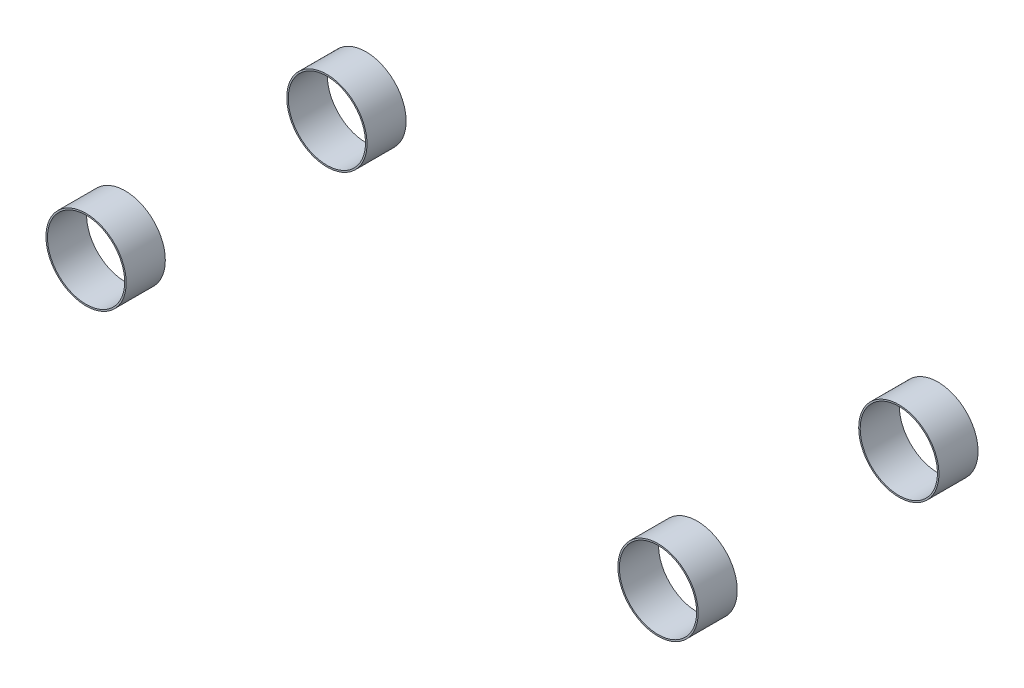
ISO-10303-21;
HEADER;
FILE_DESCRIPTION(('STEP AP214'),'2;1');
FILE_NAME('part.step','',(''),(''),'','','');
FILE_SCHEMA(('AUTOMOTIVE_DESIGN { 1 0 10303 214 1 1 1 1 }'));
ENDSEC;
DATA;
#1=APPLICATION_CONTEXT('core data for automotive mechanical design processes');
#2=APPLICATION_PROTOCOL_DEFINITION('international standard','automotive_design',2000,#1);
#3=PRODUCT_CONTEXT('',#1,'mechanical');
#4=PRODUCT('Part','Part','',(#3));
#5=PRODUCT_RELATED_PRODUCT_CATEGORY('part','',(#4));
#6=PRODUCT_DEFINITION_FORMATION('','',#4);
#7=PRODUCT_DEFINITION_CONTEXT('part definition',#1,'design');
#8=PRODUCT_DEFINITION('design','',#6,#7);
#9=PRODUCT_DEFINITION_SHAPE('','',#8);
#10=(LENGTH_UNIT() NAMED_UNIT(*) SI_UNIT(.MILLI.,.METRE.));
#11=(NAMED_UNIT(*) PLANE_ANGLE_UNIT() SI_UNIT($,.RADIAN.));
#12=(NAMED_UNIT(*) SI_UNIT($,.STERADIAN.) SOLID_ANGLE_UNIT());
#13=UNCERTAINTY_MEASURE_WITH_UNIT(LENGTH_MEASURE(1.E-05),#10,'distance_accuracy_value','');
#14=(GEOMETRIC_REPRESENTATION_CONTEXT(3) GLOBAL_UNCERTAINTY_ASSIGNED_CONTEXT((#13)) GLOBAL_UNIT_ASSIGNED_CONTEXT((#10,
#11,#12)) REPRESENTATION_CONTEXT('',''));
#15=CARTESIAN_POINT('',(0.,0.,0.));
#16=DIRECTION('',(0.,0.,1.));
#17=DIRECTION('',(1.,0.,0.));
#18=AXIS2_PLACEMENT_3D('',#15,#16,#17);
#19=CARTESIAN_POINT('',(-1425.00000000001,0.,-697.49999999999));
#20=DIRECTION('',(0.,0.,-1.));
#21=DIRECTION('',(-1.,0.,0.));
#22=AXIS2_PLACEMENT_3D('',#19,#20,#21);
#23=PLANE('',#22);
#24=CARTESIAN_POINT('',(-1425.00000000001,0.,-697.49999999999));
#25=DIRECTION('',(0.,0.,-1.));
#26=DIRECTION('',(-1.,0.,0.));
#27=AXIS2_PLACEMENT_3D('',#24,#25,#26);
#28=CIRCLE('',#27,200.);
#29=CARTESIAN_POINT('',(-1625.00000000001,0.,-697.499999999989));
#30=VERTEX_POINT('',#29);
#31=EDGE_CURVE('E11',#30,#30,#28,.T.);
#32=ORIENTED_EDGE('',*,*,#31,.T.);
#33=EDGE_LOOP('',(#32));
#34=FACE_BOUND('',#33,.T.);
#35=CARTESIAN_POINT('',(-1425.00000000001,0.,-697.49999999999));
#36=DIRECTION('',(0.,0.,-1.));
#37=DIRECTION('',(-1.,0.,0.));
#38=AXIS2_PLACEMENT_3D('',#35,#36,#37);
#39=CIRCLE('',#38,192.5);
#40=CARTESIAN_POINT('',(-1617.50000000001,0.,-697.499999999989));
#41=VERTEX_POINT('',#40);
#42=EDGE_CURVE('E55',#41,#41,#39,.T.);
#43=ORIENTED_EDGE('',*,*,#42,.F.);
#44=EDGE_LOOP('',(#43));
#45=FACE_BOUND('',#44,.T.);
#46=ADVANCED_FACE('F44',(#34,#45),#23,.T.);
#47=CARTESIAN_POINT('',(-1425.00000000001,0.,-502.49999999999));
#48=DIRECTION('',(0.,0.,-1.));
#49=DIRECTION('',(-1.,0.,0.));
#50=AXIS2_PLACEMENT_3D('',#47,#48,#49);
#51=PLANE('',#50);
#52=CARTESIAN_POINT('',(-1425.00000000001,0.,-502.49999999999));
#53=DIRECTION('',(0.,0.,-1.));
#54=DIRECTION('',(-1.,0.,0.));
#55=AXIS2_PLACEMENT_3D('',#52,#53,#54);
#56=CIRCLE('',#55,200.);
#57=CARTESIAN_POINT('',(-1625.00000000001,0.,-502.499999999989));
#58=VERTEX_POINT('',#57);
#59=EDGE_CURVE('E48',#58,#58,#56,.T.);
#60=ORIENTED_EDGE('',*,*,#59,.F.);
#61=EDGE_LOOP('',(#60));
#62=FACE_BOUND('',#61,.T.);
#63=CARTESIAN_POINT('',(-1425.00000000001,0.,-502.49999999999));
#64=DIRECTION('',(0.,0.,-1.));
#65=DIRECTION('',(-1.,0.,0.));
#66=AXIS2_PLACEMENT_3D('',#63,#64,#65);
#67=CIRCLE('',#66,192.5);
#68=CARTESIAN_POINT('',(-1617.50000000001,0.,-502.499999999989));
#69=VERTEX_POINT('',#68);
#70=EDGE_CURVE('E57',#69,#69,#67,.T.);
#71=ORIENTED_EDGE('',*,*,#70,.T.);
#72=EDGE_LOOP('',(#71));
#73=FACE_BOUND('',#72,.T.);
#74=ADVANCED_FACE('F67',(#62,#73),#51,.F.);
#75=CARTESIAN_POINT('',(-1425.00000000001,0.,-697.49999999999));
#76=DIRECTION('',(0.,0.,1.));
#77=DIRECTION('',(1.,0.,0.));
#78=AXIS2_PLACEMENT_3D('',#75,#76,#77);
#79=CYLINDRICAL_SURFACE('',#78,200.);
#80=ORIENTED_EDGE('',*,*,#31,.F.);
#81=EDGE_LOOP('',(#80));
#82=FACE_BOUND('',#81,.T.);
#83=ORIENTED_EDGE('',*,*,#59,.T.);
#84=EDGE_LOOP('',(#83));
#85=FACE_BOUND('',#84,.T.);
#86=ADVANCED_FACE('F46',(#82,#85),#79,.T.);
#87=CARTESIAN_POINT('',(-1425.00000000001,0.,-697.49999999999));
#88=DIRECTION('',(0.,0.,1.));
#89=DIRECTION('',(1.,0.,0.));
#90=AXIS2_PLACEMENT_3D('',#87,#88,#89);
#91=CYLINDRICAL_SURFACE('',#90,192.5);
#92=ORIENTED_EDGE('',*,*,#42,.T.);
#93=EDGE_LOOP('',(#92));
#94=FACE_BOUND('',#93,.T.);
#95=ORIENTED_EDGE('',*,*,#70,.F.);
#96=EDGE_LOOP('',(#95));
#97=FACE_BOUND('',#96,.T.);
#98=ADVANCED_FACE('F63',(#94,#97),#91,.F.);
#99=CLOSED_SHELL('',(#46,#74,#86,#98));
#100=MANIFOLD_SOLID_BREP('B2',#99);
#101=CARTESIAN_POINT('',(1424.99999999999,0.,-697.50000000001));
#102=DIRECTION('',(0.,0.,-1.));
#103=DIRECTION('',(-1.,0.,0.));
#104=AXIS2_PLACEMENT_3D('',#101,#102,#103);
#105=PLANE('',#104);
#106=CARTESIAN_POINT('',(1424.99999999999,0.,-697.50000000001));
#107=DIRECTION('',(0.,0.,-1.));
#108=DIRECTION('',(-1.,0.,0.));
#109=AXIS2_PLACEMENT_3D('',#106,#107,#108);
#110=CIRCLE('',#109,200.);
#111=CARTESIAN_POINT('',(1224.99999999999,0.,-697.500000000009));
#112=VERTEX_POINT('',#111);
#113=EDGE_CURVE('E43',#112,#112,#110,.T.);
#114=ORIENTED_EDGE('',*,*,#113,.T.);
#115=EDGE_LOOP('',(#114));
#116=FACE_BOUND('',#115,.T.);
#117=CARTESIAN_POINT('',(1424.99999999999,0.,-697.50000000001));
#118=DIRECTION('',(0.,0.,-1.));
#119=DIRECTION('',(-1.,0.,0.));
#120=AXIS2_PLACEMENT_3D('',#117,#118,#119);
#121=CIRCLE('',#120,192.5);
#122=CARTESIAN_POINT('',(1232.49999999999,0.,-697.500000000009));
#123=VERTEX_POINT('',#122);
#124=EDGE_CURVE('E125',#123,#123,#121,.T.);
#125=ORIENTED_EDGE('',*,*,#124,.F.);
#126=EDGE_LOOP('',(#125));
#127=FACE_BOUND('',#126,.T.);
#128=ADVANCED_FACE('F114',(#116,#127),#105,.T.);
#129=CARTESIAN_POINT('',(1424.99999999999,0.,-502.50000000001));
#130=DIRECTION('',(0.,0.,-1.));
#131=DIRECTION('',(-1.,0.,0.));
#132=AXIS2_PLACEMENT_3D('',#129,#130,#131);
#133=PLANE('',#132);
#134=CARTESIAN_POINT('',(1424.99999999999,0.,-502.50000000001));
#135=DIRECTION('',(0.,0.,-1.));
#136=DIRECTION('',(-1.,0.,0.));
#137=AXIS2_PLACEMENT_3D('',#134,#135,#136);
#138=CIRCLE('',#137,200.);
#139=CARTESIAN_POINT('',(1224.99999999999,0.,-502.500000000008));
#140=VERTEX_POINT('',#139);
#141=EDGE_CURVE('E118',#140,#140,#138,.T.);
#142=ORIENTED_EDGE('',*,*,#141,.F.);
#143=EDGE_LOOP('',(#142));
#144=FACE_BOUND('',#143,.T.);
#145=CARTESIAN_POINT('',(1424.99999999999,0.,-502.50000000001));
#146=DIRECTION('',(0.,0.,-1.));
#147=DIRECTION('',(-1.,0.,0.));
#148=AXIS2_PLACEMENT_3D('',#145,#146,#147);
#149=CIRCLE('',#148,192.5);
#150=CARTESIAN_POINT('',(1232.49999999999,0.,-502.500000000009));
#151=VERTEX_POINT('',#150);
#152=EDGE_CURVE('E127',#151,#151,#149,.T.);
#153=ORIENTED_EDGE('',*,*,#152,.T.);
#154=EDGE_LOOP('',(#153));
#155=FACE_BOUND('',#154,.T.);
#156=ADVANCED_FACE('F137',(#144,#155),#133,.F.);
#157=CARTESIAN_POINT('',(1424.99999999999,0.,-697.50000000001));
#158=DIRECTION('',(0.,0.,1.));
#159=DIRECTION('',(1.,0.,0.));
#160=AXIS2_PLACEMENT_3D('',#157,#158,#159);
#161=CYLINDRICAL_SURFACE('',#160,200.);
#162=ORIENTED_EDGE('',*,*,#113,.F.);
#163=EDGE_LOOP('',(#162));
#164=FACE_BOUND('',#163,.T.);
#165=ORIENTED_EDGE('',*,*,#141,.T.);
#166=EDGE_LOOP('',(#165));
#167=FACE_BOUND('',#166,.T.);
#168=ADVANCED_FACE('F116',(#164,#167),#161,.T.);
#169=CARTESIAN_POINT('',(1424.99999999999,0.,-697.50000000001));
#170=DIRECTION('',(0.,0.,1.));
#171=DIRECTION('',(1.,0.,0.));
#172=AXIS2_PLACEMENT_3D('',#169,#170,#171);
#173=CYLINDRICAL_SURFACE('',#172,192.5);
#174=ORIENTED_EDGE('',*,*,#124,.T.);
#175=EDGE_LOOP('',(#174));
#176=FACE_BOUND('',#175,.T.);
#177=ORIENTED_EDGE('',*,*,#152,.F.);
#178=EDGE_LOOP('',(#177));
#179=FACE_BOUND('',#178,.T.);
#180=ADVANCED_FACE('F133',(#176,#179),#173,.F.);
#181=CLOSED_SHELL('',(#128,#156,#168,#180));
#182=MANIFOLD_SOLID_BREP('B6',#181);
#183=CARTESIAN_POINT('',(1425.,0.,697.5));
#184=DIRECTION('',(0.,0.,1.));
#185=DIRECTION('',(1.,0.,0.));
#186=AXIS2_PLACEMENT_3D('',#183,#184,#185);
#187=PLANE('',#186);
#188=CARTESIAN_POINT('',(1425.,0.,697.5));
#189=DIRECTION('',(0.,0.,1.));
#190=DIRECTION('',(1.,0.,0.));
#191=AXIS2_PLACEMENT_3D('',#188,#189,#190);
#192=CIRCLE('',#191,200.);
#193=CARTESIAN_POINT('',(1625.,0.,697.5));
#194=VERTEX_POINT('',#193);
#195=EDGE_CURVE('E113',#194,#194,#192,.T.);
#196=ORIENTED_EDGE('',*,*,#195,.T.);
#197=EDGE_LOOP('',(#196));
#198=FACE_BOUND('',#197,.T.);
#199=CARTESIAN_POINT('',(1425.,0.,697.5));
#200=DIRECTION('',(0.,0.,1.));
#201=DIRECTION('',(1.,0.,0.));
#202=AXIS2_PLACEMENT_3D('',#199,#200,#201);
#203=CIRCLE('',#202,192.5);
#204=CARTESIAN_POINT('',(1617.5,0.,697.5));
#205=VERTEX_POINT('',#204);
#206=EDGE_CURVE('E194',#205,#205,#203,.T.);
#207=ORIENTED_EDGE('',*,*,#206,.F.);
#208=EDGE_LOOP('',(#207));
#209=FACE_BOUND('',#208,.T.);
#210=ADVANCED_FACE('F183',(#198,#209),#187,.T.);
#211=CARTESIAN_POINT('',(1425.,0.,502.5));
#212=DIRECTION('',(0.,0.,1.));
#213=DIRECTION('',(1.,0.,0.));
#214=AXIS2_PLACEMENT_3D('',#211,#212,#213);
#215=PLANE('',#214);
#216=CARTESIAN_POINT('',(1425.,0.,502.5));
#217=DIRECTION('',(0.,0.,1.));
#218=DIRECTION('',(1.,0.,0.));
#219=AXIS2_PLACEMENT_3D('',#216,#217,#218);
#220=CIRCLE('',#219,200.);
#221=CARTESIAN_POINT('',(1625.,0.,502.5));
#222=VERTEX_POINT('',#221);
#223=EDGE_CURVE('E187',#222,#222,#220,.T.);
#224=ORIENTED_EDGE('',*,*,#223,.F.);
#225=EDGE_LOOP('',(#224));
#226=FACE_BOUND('',#225,.T.);
#227=CARTESIAN_POINT('',(1425.,0.,502.5));
#228=DIRECTION('',(0.,0.,1.));
#229=DIRECTION('',(1.,0.,0.));
#230=AXIS2_PLACEMENT_3D('',#227,#228,#229);
#231=CIRCLE('',#230,192.5);
#232=CARTESIAN_POINT('',(1617.5,0.,502.5));
#233=VERTEX_POINT('',#232);
#234=EDGE_CURVE('E196',#233,#233,#231,.T.);
#235=ORIENTED_EDGE('',*,*,#234,.T.);
#236=EDGE_LOOP('',(#235));
#237=FACE_BOUND('',#236,.T.);
#238=ADVANCED_FACE('F206',(#226,#237),#215,.F.);
#239=CARTESIAN_POINT('',(1425.,0.,697.5));
#240=DIRECTION('',(0.,0.,-1.));
#241=DIRECTION('',(-1.,0.,0.));
#242=AXIS2_PLACEMENT_3D('',#239,#240,#241);
#243=CYLINDRICAL_SURFACE('',#242,200.);
#244=ORIENTED_EDGE('',*,*,#195,.F.);
#245=EDGE_LOOP('',(#244));
#246=FACE_BOUND('',#245,.T.);
#247=ORIENTED_EDGE('',*,*,#223,.T.);
#248=EDGE_LOOP('',(#247));
#249=FACE_BOUND('',#248,.T.);
#250=ADVANCED_FACE('F185',(#246,#249),#243,.T.);
#251=CARTESIAN_POINT('',(1425.,0.,697.5));
#252=DIRECTION('',(0.,0.,-1.));
#253=DIRECTION('',(-1.,0.,0.));
#254=AXIS2_PLACEMENT_3D('',#251,#252,#253);
#255=CYLINDRICAL_SURFACE('',#254,192.5);
#256=ORIENTED_EDGE('',*,*,#206,.T.);
#257=EDGE_LOOP('',(#256));
#258=FACE_BOUND('',#257,.T.);
#259=ORIENTED_EDGE('',*,*,#234,.F.);
#260=EDGE_LOOP('',(#259));
#261=FACE_BOUND('',#260,.T.);
#262=ADVANCED_FACE('F202',(#258,#261),#255,.F.);
#263=CLOSED_SHELL('',(#210,#238,#250,#262));
#264=MANIFOLD_SOLID_BREP('B38',#263);
#265=CARTESIAN_POINT('',(-1425.,0.,697.5));
#266=DIRECTION('',(0.,0.,1.));
#267=DIRECTION('',(1.,0.,0.));
#268=AXIS2_PLACEMENT_3D('',#265,#266,#267);
#269=PLANE('',#268);
#270=CARTESIAN_POINT('',(-1425.,0.,697.5));
#271=DIRECTION('',(0.,0.,1.));
#272=DIRECTION('',(1.,0.,0.));
#273=AXIS2_PLACEMENT_3D('',#270,#271,#272);
#274=CIRCLE('',#273,200.);
#275=CARTESIAN_POINT('',(-1225.,0.,697.5));
#276=VERTEX_POINT('',#275);
#277=EDGE_CURVE('E182',#276,#276,#274,.T.);
#278=ORIENTED_EDGE('',*,*,#277,.T.);
#279=EDGE_LOOP('',(#278));
#280=FACE_BOUND('',#279,.T.);
#281=CARTESIAN_POINT('',(-1425.,0.,697.5));
#282=DIRECTION('',(0.,0.,1.));
#283=DIRECTION('',(1.,0.,0.));
#284=AXIS2_PLACEMENT_3D('',#281,#282,#283);
#285=CIRCLE('',#284,192.5);
#286=CARTESIAN_POINT('',(-1232.5,0.,697.5));
#287=VERTEX_POINT('',#286);
#288=EDGE_CURVE('E256',#287,#287,#285,.T.);
#289=ORIENTED_EDGE('',*,*,#288,.F.);
#290=EDGE_LOOP('',(#289));
#291=FACE_BOUND('',#290,.T.);
#292=ADVANCED_FACE('F245',(#280,#291),#269,.T.);
#293=CARTESIAN_POINT('',(-1425.,0.,502.5));
#294=DIRECTION('',(0.,0.,1.));
#295=DIRECTION('',(1.,0.,0.));
#296=AXIS2_PLACEMENT_3D('',#293,#294,#295);
#297=PLANE('',#296);
#298=CARTESIAN_POINT('',(-1425.,0.,502.5));
#299=DIRECTION('',(0.,0.,1.));
#300=DIRECTION('',(1.,0.,0.));
#301=AXIS2_PLACEMENT_3D('',#298,#299,#300);
#302=CIRCLE('',#301,200.);
#303=CARTESIAN_POINT('',(-1225.,0.,502.5));
#304=VERTEX_POINT('',#303);
#305=EDGE_CURVE('E249',#304,#304,#302,.T.);
#306=ORIENTED_EDGE('',*,*,#305,.F.);
#307=EDGE_LOOP('',(#306));
#308=FACE_BOUND('',#307,.T.);
#309=CARTESIAN_POINT('',(-1425.,0.,502.5));
#310=DIRECTION('',(0.,0.,1.));
#311=DIRECTION('',(1.,0.,0.));
#312=AXIS2_PLACEMENT_3D('',#309,#310,#311);
#313=CIRCLE('',#312,192.5);
#314=CARTESIAN_POINT('',(-1232.5,0.,502.5));
#315=VERTEX_POINT('',#314);
#316=EDGE_CURVE('E258',#315,#315,#313,.T.);
#317=ORIENTED_EDGE('',*,*,#316,.T.);
#318=EDGE_LOOP('',(#317));
#319=FACE_BOUND('',#318,.T.);
#320=ADVANCED_FACE('F268',(#308,#319),#297,.F.);
#321=CARTESIAN_POINT('',(-1425.,0.,697.5));
#322=DIRECTION('',(0.,0.,-1.));
#323=DIRECTION('',(-1.,0.,0.));
#324=AXIS2_PLACEMENT_3D('',#321,#322,#323);
#325=CYLINDRICAL_SURFACE('',#324,200.);
#326=ORIENTED_EDGE('',*,*,#277,.F.);
#327=EDGE_LOOP('',(#326));
#328=FACE_BOUND('',#327,.T.);
#329=ORIENTED_EDGE('',*,*,#305,.T.);
#330=EDGE_LOOP('',(#329));
#331=FACE_BOUND('',#330,.T.);
#332=ADVANCED_FACE('F247',(#328,#331),#325,.T.);
#333=CARTESIAN_POINT('',(-1425.,0.,697.5));
#334=DIRECTION('',(0.,0.,-1.));
#335=DIRECTION('',(-1.,0.,0.));
#336=AXIS2_PLACEMENT_3D('',#333,#334,#335);
#337=CYLINDRICAL_SURFACE('',#336,192.5);
#338=ORIENTED_EDGE('',*,*,#288,.T.);
#339=EDGE_LOOP('',(#338));
#340=FACE_BOUND('',#339,.T.);
#341=ORIENTED_EDGE('',*,*,#316,.F.);
#342=EDGE_LOOP('',(#341));
#343=FACE_BOUND('',#342,.T.);
#344=ADVANCED_FACE('F264',(#340,#343),#337,.F.);
#345=CLOSED_SHELL('',(#292,#320,#332,#344));
#346=MANIFOLD_SOLID_BREP('B108',#345);
#347=ADVANCED_BREP_SHAPE_REPRESENTATION('',(#18,#100,#182,#264,#346),#14);
#348=SHAPE_DEFINITION_REPRESENTATION(#9,#347);
ENDSEC;
END-ISO-10303-21;
